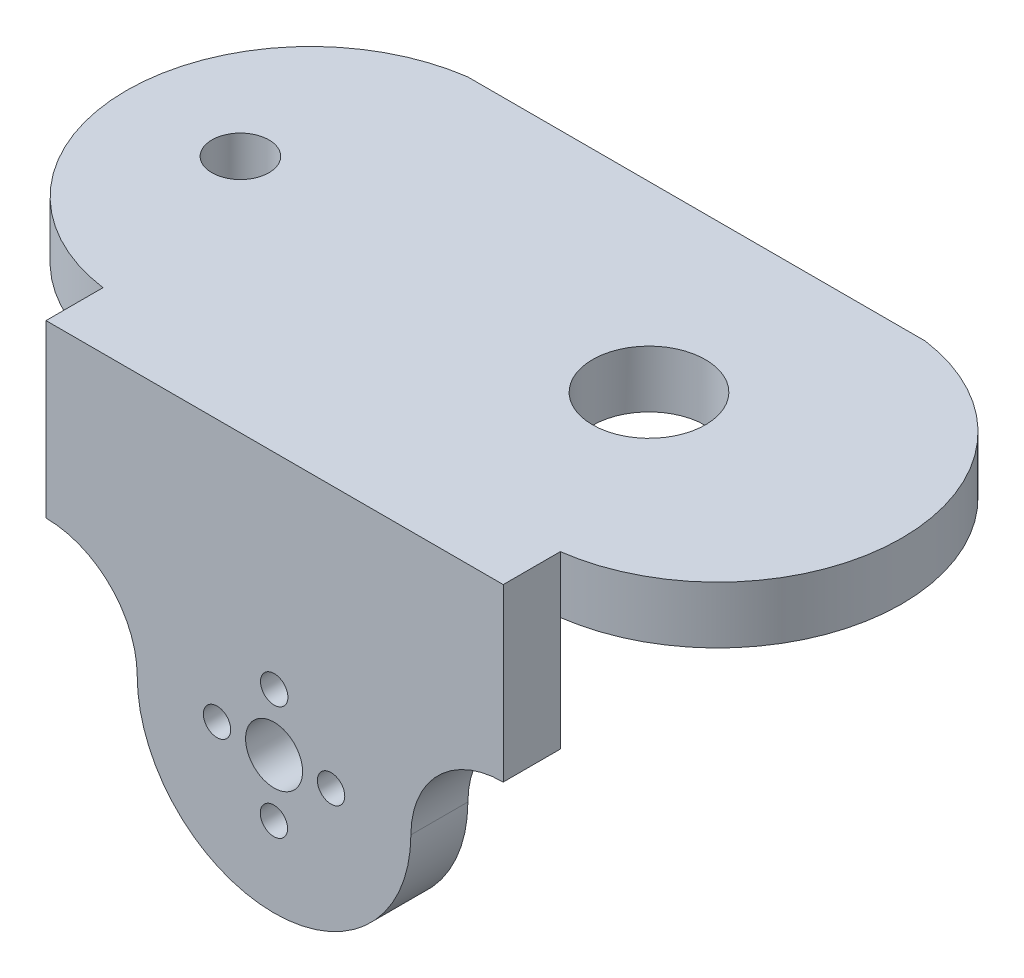
ISO-10303-21;
HEADER;
FILE_DESCRIPTION(('STEP AP214'),'2;1');
FILE_NAME('part.step','',(''),(''),'','','');
FILE_SCHEMA(('AUTOMOTIVE_DESIGN { 1 0 10303 214 1 1 1 1 }'));
ENDSEC;
DATA;
#1=APPLICATION_CONTEXT('core data for automotive mechanical design processes');
#2=APPLICATION_PROTOCOL_DEFINITION('international standard','automotive_design',2000,#1);
#3=PRODUCT_CONTEXT('',#1,'mechanical');
#4=PRODUCT('Part','Part','',(#3));
#5=PRODUCT_RELATED_PRODUCT_CATEGORY('part','',(#4));
#6=PRODUCT_DEFINITION_FORMATION('','',#4);
#7=PRODUCT_DEFINITION_CONTEXT('part definition',#1,'design');
#8=PRODUCT_DEFINITION('design','',#6,#7);
#9=PRODUCT_DEFINITION_SHAPE('','',#8);
#10=(LENGTH_UNIT() NAMED_UNIT(*) SI_UNIT(.MILLI.,.METRE.));
#11=(NAMED_UNIT(*) PLANE_ANGLE_UNIT() SI_UNIT($,.RADIAN.));
#12=(NAMED_UNIT(*) SI_UNIT($,.STERADIAN.) SOLID_ANGLE_UNIT());
#13=UNCERTAINTY_MEASURE_WITH_UNIT(LENGTH_MEASURE(1.E-05),#10,'distance_accuracy_value','');
#14=(GEOMETRIC_REPRESENTATION_CONTEXT(3) GLOBAL_UNCERTAINTY_ASSIGNED_CONTEXT((#13)) GLOBAL_UNIT_ASSIGNED_CONTEXT((#10,
#11,#12)) REPRESENTATION_CONTEXT('',''));
#15=CARTESIAN_POINT('',(0.,0.,0.));
#16=DIRECTION('',(0.,0.,1.));
#17=DIRECTION('',(1.,0.,0.));
#18=AXIS2_PLACEMENT_3D('',#15,#16,#17);
#19=CARTESIAN_POINT('',(40.1,0.,5.));
#20=DIRECTION('',(1.,0.,0.));
#21=DIRECTION('',(0.,0.,-1.));
#22=AXIS2_PLACEMENT_3D('',#19,#20,#21);
#23=PLANE('',#22);
#24=DIRECTION('',(0.,1.,0.));
#25=VECTOR('',#24,1.);
#26=CARTESIAN_POINT('',(40.1,-34.9084875066222,0.));
#27=LINE('',#26,#25);
#28=CARTESIAN_POINT('',(40.1,0.,0.));
#29=VERTEX_POINT('',#28);
#30=CARTESIAN_POINT('',(40.1,5.,0.));
#31=VERTEX_POINT('',#30);
#32=EDGE_CURVE('E56',#29,#31,#27,.T.);
#33=ORIENTED_EDGE('',*,*,#32,.T.);
#34=DIRECTION('',(0.,0.,1.));
#35=VECTOR('',#34,1.);
#36=CARTESIAN_POINT('',(40.1,5.,-32.));
#37=LINE('',#36,#35);
#38=CARTESIAN_POINT('',(40.1,5.,5.));
#39=VERTEX_POINT('',#38);
#40=EDGE_CURVE('E122',#31,#39,#37,.T.);
#41=ORIENTED_EDGE('',*,*,#40,.T.);
#42=DIRECTION('',(0.,-1.,0.));
#43=VECTOR('',#42,1.);
#44=CARTESIAN_POINT('',(40.1,0.,5.));
#45=LINE('',#44,#43);
#46=CARTESIAN_POINT('',(40.1,-10.,5.));
#47=VERTEX_POINT('',#46);
#48=EDGE_CURVE('E159',#39,#47,#45,.T.);
#49=ORIENTED_EDGE('',*,*,#48,.T.);
#50=DIRECTION('',(0.,0.,-1.));
#51=VECTOR('',#50,1.);
#52=CARTESIAN_POINT('',(40.1,-10.,5.));
#53=LINE('',#52,#51);
#54=CARTESIAN_POINT('',(40.1,-10.,0.));
#55=VERTEX_POINT('',#54);
#56=EDGE_CURVE('E171',#47,#55,#53,.T.);
#57=ORIENTED_EDGE('',*,*,#56,.T.);
#58=DIRECTION('',(0.,-1.,0.));
#59=VECTOR('',#58,1.);
#60=CARTESIAN_POINT('',(40.1,0.,0.));
#61=LINE('',#60,#59);
#62=EDGE_CURVE('E157',#29,#55,#61,.T.);
#63=ORIENTED_EDGE('',*,*,#62,.F.);
#64=EDGE_LOOP('',(#33,#41,#49,#57,#63));
#65=FACE_BOUND('',#64,.T.);
#66=ADVANCED_FACE('F40',(#65),#23,.T.);
#67=CARTESIAN_POINT('',(0.,0.,5.));
#68=DIRECTION('',(1.,0.,0.));
#69=DIRECTION('',(0.,1.,0.));
#70=AXIS2_PLACEMENT_3D('',#67,#68,#69);
#71=PLANE('',#70);
#72=DIRECTION('',(0.,0.,1.));
#73=VECTOR('',#72,1.);
#74=CARTESIAN_POINT('',(0.,5.,-32.));
#75=LINE('',#74,#73);
#76=CARTESIAN_POINT('',(0.,5.,0.));
#77=VERTEX_POINT('',#76);
#78=CARTESIAN_POINT('',(0.,5.,5.));
#79=VERTEX_POINT('',#78);
#80=EDGE_CURVE('E64',#77,#79,#75,.T.);
#81=ORIENTED_EDGE('',*,*,#80,.F.);
#82=DIRECTION('',(0.,1.,0.));
#83=VECTOR('',#82,1.);
#84=CARTESIAN_POINT('',(0.,-34.9084875066222,0.));
#85=LINE('',#84,#83);
#86=CARTESIAN_POINT('',(0.,0.,0.));
#87=VERTEX_POINT('',#86);
#88=EDGE_CURVE('E149',#87,#77,#85,.T.);
#89=ORIENTED_EDGE('',*,*,#88,.F.);
#90=DIRECTION('',(0.,-1.,0.));
#91=VECTOR('',#90,1.);
#92=CARTESIAN_POINT('',(0.,0.,0.));
#93=LINE('',#92,#91);
#94=CARTESIAN_POINT('',(0.,-10.,0.));
#95=VERTEX_POINT('',#94);
#96=EDGE_CURVE('E177',#87,#95,#93,.T.);
#97=ORIENTED_EDGE('',*,*,#96,.T.);
#98=DIRECTION('',(0.,0.,-1.));
#99=VECTOR('',#98,1.);
#100=CARTESIAN_POINT('',(0.,-10.,5.));
#101=LINE('',#100,#99);
#102=CARTESIAN_POINT('',(0.,-10.,5.));
#103=VERTEX_POINT('',#102);
#104=EDGE_CURVE('E11',#103,#95,#101,.T.);
#105=ORIENTED_EDGE('',*,*,#104,.F.);
#106=DIRECTION('',(0.,-1.,0.));
#107=VECTOR('',#106,1.);
#108=CARTESIAN_POINT('',(0.,0.,5.));
#109=LINE('',#108,#107);
#110=EDGE_CURVE('E162',#79,#103,#109,.T.);
#111=ORIENTED_EDGE('',*,*,#110,.F.);
#112=EDGE_LOOP('',(#81,#89,#97,#105,#111));
#113=FACE_BOUND('',#112,.T.);
#114=ADVANCED_FACE('F225',(#113),#71,.F.);
#115=CARTESIAN_POINT('',(0.,-18.,5.));
#116=DIRECTION('',(0.,0.,-1.));
#117=DIRECTION('',(-1.,0.,0.));
#118=AXIS2_PLACEMENT_3D('',#115,#116,#117);
#119=CYLINDRICAL_SURFACE('',#118,8.);
#120=CARTESIAN_POINT('',(0.,-18.,0.));
#121=DIRECTION('',(0.,0.,1.));
#122=DIRECTION('',(1.,0.,0.));
#123=AXIS2_PLACEMENT_3D('',#120,#121,#122);
#124=CIRCLE('',#123,8.);
#125=CARTESIAN_POINT('',(8.,-18.,0.));
#126=VERTEX_POINT('',#125);
#127=EDGE_CURVE('E179',#95,#126,#124,.F.);
#128=ORIENTED_EDGE('',*,*,#127,.T.);
#129=DIRECTION('',(0.,0.,-1.));
#130=VECTOR('',#129,1.);
#131=CARTESIAN_POINT('',(8.,-18.,5.));
#132=LINE('',#131,#130);
#133=CARTESIAN_POINT('',(8.,-18.,5.));
#134=VERTEX_POINT('',#133);
#135=EDGE_CURVE('E48',#134,#126,#132,.T.);
#136=ORIENTED_EDGE('',*,*,#135,.F.);
#137=CARTESIAN_POINT('',(0.,-18.,5.));
#138=DIRECTION('',(0.,0.,1.));
#139=DIRECTION('',(1.,0.,0.));
#140=AXIS2_PLACEMENT_3D('',#137,#138,#139);
#141=CIRCLE('',#140,8.);
#142=EDGE_CURVE('E165',#103,#134,#141,.F.);
#143=ORIENTED_EDGE('',*,*,#142,.F.);
#144=ORIENTED_EDGE('',*,*,#104,.T.);
#145=EDGE_LOOP('',(#128,#136,#143,#144));
#146=FACE_BOUND('',#145,.T.);
#147=ADVANCED_FACE('F229',(#146),#119,.F.);
#148=CARTESIAN_POINT('',(20.,-18.,5.));
#149=DIRECTION('',(0.,0.,-1.));
#150=DIRECTION('',(-1.,0.,0.));
#151=AXIS2_PLACEMENT_3D('',#148,#149,#150);
#152=CYLINDRICAL_SURFACE('',#151,12.);
#153=CARTESIAN_POINT('',(20.,-18.,0.));
#154=DIRECTION('',(0.,0.,1.));
#155=DIRECTION('',(1.,0.,0.));
#156=AXIS2_PLACEMENT_3D('',#153,#154,#155);
#157=CIRCLE('',#156,12.);
#158=CARTESIAN_POINT('',(31.999850748125,-18.0598500018656,0.));
#159=VERTEX_POINT('',#158);
#160=EDGE_CURVE('E181',#126,#159,#157,.T.);
#161=ORIENTED_EDGE('',*,*,#160,.T.);
#162=DIRECTION('',(0.,0.,-1.));
#163=VECTOR('',#162,1.);
#164=CARTESIAN_POINT('',(31.999850748125,-18.0598500018656,5.));
#165=LINE('',#164,#163);
#166=CARTESIAN_POINT('',(31.999850748125,-18.0598500018656,5.));
#167=VERTEX_POINT('',#166);
#168=EDGE_CURVE('E186',#167,#159,#165,.T.);
#169=ORIENTED_EDGE('',*,*,#168,.F.);
#170=CARTESIAN_POINT('',(20.,-18.,5.));
#171=DIRECTION('',(0.,0.,1.));
#172=DIRECTION('',(1.,0.,0.));
#173=AXIS2_PLACEMENT_3D('',#170,#171,#172);
#174=CIRCLE('',#173,12.);
#175=EDGE_CURVE('E167',#134,#167,#174,.T.);
#176=ORIENTED_EDGE('',*,*,#175,.F.);
#177=ORIENTED_EDGE('',*,*,#135,.T.);
#178=EDGE_LOOP('',(#161,#169,#176,#177));
#179=FACE_BOUND('',#178,.T.);
#180=ADVANCED_FACE('F233',(#179),#152,.T.);
#181=CARTESIAN_POINT('',(40.1,-18.10025,5.));
#182=DIRECTION('',(0.,0.,-1.));
#183=DIRECTION('',(-1.,0.,0.));
#184=AXIS2_PLACEMENT_3D('',#181,#182,#183);
#185=CYLINDRICAL_SURFACE('',#184,8.10025);
#186=CARTESIAN_POINT('',(40.1,-18.10025,0.));
#187=DIRECTION('',(0.,0.,1.));
#188=DIRECTION('',(1.,0.,0.));
#189=AXIS2_PLACEMENT_3D('',#186,#187,#188);
#190=CIRCLE('',#189,8.10025);
#191=EDGE_CURVE('E163',#159,#55,#190,.F.);
#192=ORIENTED_EDGE('',*,*,#191,.T.);
#193=ORIENTED_EDGE('',*,*,#56,.F.);
#194=CARTESIAN_POINT('',(40.1,-18.10025,5.));
#195=DIRECTION('',(0.,0.,1.));
#196=DIRECTION('',(1.,0.,0.));
#197=AXIS2_PLACEMENT_3D('',#194,#195,#196);
#198=CIRCLE('',#197,8.10025);
#199=EDGE_CURVE('E169',#167,#47,#198,.F.);
#200=ORIENTED_EDGE('',*,*,#199,.F.);
#201=ORIENTED_EDGE('',*,*,#168,.T.);
#202=EDGE_LOOP('',(#192,#193,#200,#201));
#203=FACE_BOUND('',#202,.T.);
#204=ADVANCED_FACE('F239',(#203),#185,.F.);
#205=CARTESIAN_POINT('',(0.,0.,5.));
#206=DIRECTION('',(0.,0.,1.));
#207=DIRECTION('',(1.,0.,0.));
#208=AXIS2_PLACEMENT_3D('',#205,#206,#207);
#209=PLANE('',#208);
#210=CARTESIAN_POINT('',(20.0124688279302,-13.,5.));
#211=DIRECTION('',(0.,0.,1.));
#212=DIRECTION('',(1.,0.,0.));
#213=AXIS2_PLACEMENT_3D('',#210,#211,#212);
#214=CIRCLE('',#213,1.2);
#215=CARTESIAN_POINT('',(21.2124688279302,-13.,5.));
#216=VERTEX_POINT('',#215);
#217=EDGE_CURVE('E195',#216,#216,#214,.T.);
#218=ORIENTED_EDGE('',*,*,#217,.F.);
#219=EDGE_LOOP('',(#218));
#220=FACE_BOUND('',#219,.T.);
#221=CARTESIAN_POINT('',(25.,-18.0249378109453,5.));
#222=DIRECTION('',(0.,0.,1.));
#223=DIRECTION('',(1.,0.,0.));
#224=AXIS2_PLACEMENT_3D('',#221,#222,#223);
#225=CIRCLE('',#224,1.2);
#226=CARTESIAN_POINT('',(26.2,-18.0249378109453,5.));
#227=VERTEX_POINT('',#226);
#228=EDGE_CURVE('E302',#227,#227,#225,.T.);
#229=ORIENTED_EDGE('',*,*,#228,.F.);
#230=EDGE_LOOP('',(#229));
#231=FACE_BOUND('',#230,.T.);
#232=CARTESIAN_POINT('',(19.9875311720698,-23.,5.));
#233=DIRECTION('',(0.,0.,1.));
#234=DIRECTION('',(1.,0.,0.));
#235=AXIS2_PLACEMENT_3D('',#232,#233,#234);
#236=CIRCLE('',#235,1.2);
#237=CARTESIAN_POINT('',(21.1875311720698,-23.,5.));
#238=VERTEX_POINT('',#237);
#239=EDGE_CURVE('E300',#238,#238,#236,.T.);
#240=ORIENTED_EDGE('',*,*,#239,.F.);
#241=EDGE_LOOP('',(#240));
#242=FACE_BOUND('',#241,.T.);
#243=CARTESIAN_POINT('',(15.,-17.9750621890547,5.));
#244=DIRECTION('',(0.,0.,1.));
#245=DIRECTION('',(1.,0.,0.));
#246=AXIS2_PLACEMENT_3D('',#243,#244,#245);
#247=CIRCLE('',#246,1.2);
#248=CARTESIAN_POINT('',(16.2,-17.9750621890547,5.));
#249=VERTEX_POINT('',#248);
#250=EDGE_CURVE('E141',#249,#249,#247,.T.);
#251=ORIENTED_EDGE('',*,*,#250,.F.);
#252=EDGE_LOOP('',(#251));
#253=FACE_BOUND('',#252,.T.);
#254=CARTESIAN_POINT('',(20.,-18.,5.));
#255=DIRECTION('',(0.,0.,1.));
#256=DIRECTION('',(1.,0.,0.));
#257=AXIS2_PLACEMENT_3D('',#254,#255,#256);
#258=CIRCLE('',#257,2.5);
#259=CARTESIAN_POINT('',(22.5,-18.,5.));
#260=VERTEX_POINT('',#259);
#261=EDGE_CURVE('E276',#260,#260,#258,.T.);
#262=ORIENTED_EDGE('',*,*,#261,.F.);
#263=EDGE_LOOP('',(#262));
#264=FACE_BOUND('',#263,.T.);
#265=ORIENTED_EDGE('',*,*,#48,.F.);
#266=DIRECTION('',(-1.,0.,0.));
#267=VECTOR('',#266,1.);
#268=CARTESIAN_POINT('',(0.,5.,5.));
#269=LINE('',#268,#267);
#270=EDGE_CURVE('E151',#39,#79,#269,.T.);
#271=ORIENTED_EDGE('',*,*,#270,.T.);
#272=ORIENTED_EDGE('',*,*,#110,.T.);
#273=ORIENTED_EDGE('',*,*,#142,.T.);
#274=ORIENTED_EDGE('',*,*,#175,.T.);
#275=ORIENTED_EDGE('',*,*,#199,.T.);
#276=EDGE_LOOP('',(#265,#271,#272,#273,#274,#275));
#277=FACE_BOUND('',#276,.T.);
#278=ADVANCED_FACE('F243',(#220,#231,#242,#253,#264,#277),#209,.T.);
#279=CARTESIAN_POINT('',(0.,0.,0.));
#280=DIRECTION('',(0.,0.,1.));
#281=DIRECTION('',(1.,0.,0.));
#282=AXIS2_PLACEMENT_3D('',#279,#280,#281);
#283=PLANE('',#282);
#284=CARTESIAN_POINT('',(20.0124688279302,-13.,0.));
#285=DIRECTION('',(0.,0.,1.));
#286=DIRECTION('',(1.,0.,0.));
#287=AXIS2_PLACEMENT_3D('',#284,#285,#286);
#288=CIRCLE('',#287,1.2);
#289=CARTESIAN_POINT('',(21.2124688279302,-13.,0.));
#290=VERTEX_POINT('',#289);
#291=EDGE_CURVE('E43',#290,#290,#288,.T.);
#292=ORIENTED_EDGE('',*,*,#291,.T.);
#293=EDGE_LOOP('',(#292));
#294=FACE_BOUND('',#293,.T.);
#295=CARTESIAN_POINT('',(25.,-18.0249378109453,0.));
#296=DIRECTION('',(0.,0.,1.));
#297=DIRECTION('',(1.,0.,0.));
#298=AXIS2_PLACEMENT_3D('',#295,#296,#297);
#299=CIRCLE('',#298,1.2);
#300=CARTESIAN_POINT('',(26.2,-18.0249378109453,0.));
#301=VERTEX_POINT('',#300);
#302=EDGE_CURVE('E138',#301,#301,#299,.T.);
#303=ORIENTED_EDGE('',*,*,#302,.T.);
#304=EDGE_LOOP('',(#303));
#305=FACE_BOUND('',#304,.T.);
#306=CARTESIAN_POINT('',(19.9875311720698,-23.,0.));
#307=DIRECTION('',(0.,0.,1.));
#308=DIRECTION('',(1.,0.,0.));
#309=AXIS2_PLACEMENT_3D('',#306,#307,#308);
#310=CIRCLE('',#309,1.2);
#311=CARTESIAN_POINT('',(21.1875311720698,-23.,0.));
#312=VERTEX_POINT('',#311);
#313=EDGE_CURVE('E198',#312,#312,#310,.T.);
#314=ORIENTED_EDGE('',*,*,#313,.T.);
#315=EDGE_LOOP('',(#314));
#316=FACE_BOUND('',#315,.T.);
#317=CARTESIAN_POINT('',(15.,-17.9750621890547,0.));
#318=DIRECTION('',(0.,0.,1.));
#319=DIRECTION('',(1.,0.,0.));
#320=AXIS2_PLACEMENT_3D('',#317,#318,#319);
#321=CIRCLE('',#320,1.2);
#322=CARTESIAN_POINT('',(16.2,-17.9750621890547,0.));
#323=VERTEX_POINT('',#322);
#324=EDGE_CURVE('E194',#323,#323,#321,.T.);
#325=ORIENTED_EDGE('',*,*,#324,.T.);
#326=EDGE_LOOP('',(#325));
#327=FACE_BOUND('',#326,.T.);
#328=CARTESIAN_POINT('',(20.,-18.,0.));
#329=DIRECTION('',(0.,0.,1.));
#330=DIRECTION('',(1.,0.,0.));
#331=AXIS2_PLACEMENT_3D('',#328,#329,#330);
#332=CIRCLE('',#331,2.5);
#333=CARTESIAN_POINT('',(22.5,-18.,0.));
#334=VERTEX_POINT('',#333);
#335=EDGE_CURVE('E191',#334,#334,#332,.T.);
#336=ORIENTED_EDGE('',*,*,#335,.T.);
#337=EDGE_LOOP('',(#336));
#338=FACE_BOUND('',#337,.T.);
#339=ORIENTED_EDGE('',*,*,#62,.T.);
#340=ORIENTED_EDGE('',*,*,#191,.F.);
#341=ORIENTED_EDGE('',*,*,#160,.F.);
#342=ORIENTED_EDGE('',*,*,#127,.F.);
#343=ORIENTED_EDGE('',*,*,#96,.F.);
#344=DIRECTION('',(1.,0.,0.));
#345=VECTOR('',#344,1.);
#346=CARTESIAN_POINT('',(0.,0.,0.));
#347=LINE('',#346,#345);
#348=EDGE_CURVE('E174',#87,#29,#347,.T.);
#349=ORIENTED_EDGE('',*,*,#348,.T.);
#350=EDGE_LOOP('',(#339,#340,#341,#342,#343,#349));
#351=FACE_BOUND('',#350,.T.);
#352=ADVANCED_FACE('F203',(#294,#305,#316,#327,#338,#351),#283,.F.);
#353=CARTESIAN_POINT('',(0.,0.,-32.));
#354=DIRECTION('',(0.,-1.,0.));
#355=DIRECTION('',(0.,0.,-1.));
#356=AXIS2_PLACEMENT_3D('',#353,#354,#355);
#357=PLANE('',#356);
#358=CARTESIAN_POINT('',(31.88,0.,-16.));
#359=DIRECTION('',(0.,-1.,0.));
#360=DIRECTION('',(0.,0.,-1.));
#361=AXIS2_PLACEMENT_3D('',#358,#359,#360);
#362=CIRCLE('',#361,4.95499999999998);
#363=CARTESIAN_POINT('',(31.88,0.,-20.955));
#364=VERTEX_POINT('',#363);
#365=EDGE_CURVE('E304',#364,#364,#362,.T.);
#366=ORIENTED_EDGE('',*,*,#365,.F.);
#367=EDGE_LOOP('',(#366));
#368=FACE_BOUND('',#367,.T.);
#369=CARTESIAN_POINT('',(-3.95,0.,-16.));
#370=DIRECTION('',(0.,-1.,0.));
#371=DIRECTION('',(0.,0.,-1.));
#372=AXIS2_PLACEMENT_3D('',#369,#370,#371);
#373=CIRCLE('',#372,2.5);
#374=CARTESIAN_POINT('',(-3.95,0.,-18.5));
#375=VERTEX_POINT('',#374);
#376=EDGE_CURVE('E309',#375,#375,#373,.T.);
#377=ORIENTED_EDGE('',*,*,#376,.F.);
#378=EDGE_LOOP('',(#377));
#379=FACE_BOUND('',#378,.T.);
#380=ORIENTED_EDGE('',*,*,#348,.F.);
#381=CARTESIAN_POINT('',(2.20062724014337,0.,-16.));
#382=DIRECTION('',(0.,-1.,0.));
#383=DIRECTION('',(0.,0.,-1.));
#384=AXIS2_PLACEMENT_3D('',#381,#382,#383);
#385=CIRCLE('',#384,16.1506272401434);
#386=CARTESIAN_POINT('',(0.,0.,-32.));
#387=VERTEX_POINT('',#386);
#388=EDGE_CURVE('E146',#387,#87,#385,.F.);
#389=ORIENTED_EDGE('',*,*,#388,.F.);
#390=DIRECTION('',(1.,0.,0.));
#391=VECTOR('',#390,1.);
#392=CARTESIAN_POINT('',(0.,0.,-32.));
#393=LINE('',#392,#391);
#394=CARTESIAN_POINT('',(40.1,0.,-32.));
#395=VERTEX_POINT('',#394);
#396=EDGE_CURVE('E131',#387,#395,#393,.T.);
#397=ORIENTED_EDGE('',*,*,#396,.T.);
#398=CARTESIAN_POINT('',(37.8993727598566,0.,-16.));
#399=DIRECTION('',(0.,-1.,0.));
#400=DIRECTION('',(0.,0.,-1.));
#401=AXIS2_PLACEMENT_3D('',#398,#399,#400);
#402=CIRCLE('',#401,16.1506272401434);
#403=EDGE_CURVE('E130',#29,#395,#402,.F.);
#404=ORIENTED_EDGE('',*,*,#403,.F.);
#405=EDGE_LOOP('',(#380,#389,#397,#404));
#406=FACE_BOUND('',#405,.T.);
#407=ADVANCED_FACE('F247',(#368,#379,#406),#357,.T.);
#408=CARTESIAN_POINT('',(0.,5.,-32.));
#409=DIRECTION('',(0.,1.,0.));
#410=DIRECTION('',(0.,0.,1.));
#411=AXIS2_PLACEMENT_3D('',#408,#409,#410);
#412=PLANE('',#411);
#413=CARTESIAN_POINT('',(31.88,5.,-16.));
#414=DIRECTION('',(0.,1.,0.));
#415=DIRECTION('',(0.,0.,1.));
#416=AXIS2_PLACEMENT_3D('',#413,#414,#415);
#417=CIRCLE('',#416,4.95499999999998);
#418=CARTESIAN_POINT('',(31.88,5.,-11.045));
#419=VERTEX_POINT('',#418);
#420=EDGE_CURVE('E312',#419,#419,#417,.T.);
#421=ORIENTED_EDGE('',*,*,#420,.F.);
#422=EDGE_LOOP('',(#421));
#423=FACE_BOUND('',#422,.T.);
#424=CARTESIAN_POINT('',(-3.95,5.,-16.));
#425=DIRECTION('',(0.,1.,0.));
#426=DIRECTION('',(0.,0.,1.));
#427=AXIS2_PLACEMENT_3D('',#424,#425,#426);
#428=CIRCLE('',#427,2.5);
#429=CARTESIAN_POINT('',(-3.95,5.,-13.5));
#430=VERTEX_POINT('',#429);
#431=EDGE_CURVE('E313',#430,#430,#428,.T.);
#432=ORIENTED_EDGE('',*,*,#431,.F.);
#433=EDGE_LOOP('',(#432));
#434=FACE_BOUND('',#433,.T.);
#435=ORIENTED_EDGE('',*,*,#270,.F.);
#436=ORIENTED_EDGE('',*,*,#40,.F.);
#437=CARTESIAN_POINT('',(37.8993727598566,5.,-16.));
#438=DIRECTION('',(0.,1.,0.));
#439=DIRECTION('',(0.,0.,1.));
#440=AXIS2_PLACEMENT_3D('',#437,#438,#439);
#441=CIRCLE('',#440,16.1506272401434);
#442=CARTESIAN_POINT('',(40.1,5.,-32.));
#443=VERTEX_POINT('',#442);
#444=EDGE_CURVE('E128',#31,#443,#441,.T.);
#445=ORIENTED_EDGE('',*,*,#444,.T.);
#446=DIRECTION('',(-1.,0.,0.));
#447=VECTOR('',#446,1.);
#448=CARTESIAN_POINT('',(0.,5.,-32.));
#449=LINE('',#448,#447);
#450=CARTESIAN_POINT('',(0.,5.,-32.));
#451=VERTEX_POINT('',#450);
#452=EDGE_CURVE('E111',#443,#451,#449,.T.);
#453=ORIENTED_EDGE('',*,*,#452,.T.);
#454=CARTESIAN_POINT('',(2.20062724014337,5.,-16.));
#455=DIRECTION('',(0.,1.,0.));
#456=DIRECTION('',(0.,0.,-1.));
#457=AXIS2_PLACEMENT_3D('',#454,#455,#456);
#458=CIRCLE('',#457,16.1506272401434);
#459=EDGE_CURVE('E143',#451,#77,#458,.T.);
#460=ORIENTED_EDGE('',*,*,#459,.T.);
#461=ORIENTED_EDGE('',*,*,#80,.T.);
#462=EDGE_LOOP('',(#435,#436,#445,#453,#460,#461));
#463=FACE_BOUND('',#462,.T.);
#464=ADVANCED_FACE('F134',(#423,#434,#463),#412,.T.);
#465=CARTESIAN_POINT('',(0.,0.,-32.));
#466=DIRECTION('',(0.,0.,-1.));
#467=DIRECTION('',(-1.,0.,0.));
#468=AXIS2_PLACEMENT_3D('',#465,#466,#467);
#469=PLANE('',#468);
#470=DIRECTION('',(0.,-1.,0.));
#471=VECTOR('',#470,1.);
#472=CARTESIAN_POINT('',(0.,0.,-32.));
#473=LINE('',#472,#471);
#474=EDGE_CURVE('E117',#451,#387,#473,.T.);
#475=ORIENTED_EDGE('',*,*,#474,.F.);
#476=ORIENTED_EDGE('',*,*,#452,.F.);
#477=DIRECTION('',(0.,1.,0.));
#478=VECTOR('',#477,1.);
#479=CARTESIAN_POINT('',(40.1,0.,-32.));
#480=LINE('',#479,#478);
#481=EDGE_CURVE('E114',#395,#443,#480,.T.);
#482=ORIENTED_EDGE('',*,*,#481,.F.);
#483=ORIENTED_EDGE('',*,*,#396,.F.);
#484=EDGE_LOOP('',(#475,#476,#482,#483));
#485=FACE_BOUND('',#484,.T.);
#486=ADVANCED_FACE('F113',(#485),#469,.T.);
#487=CARTESIAN_POINT('',(2.20062724014337,-34.9084875066222,-16.));
#488=DIRECTION('',(0.,1.,0.));
#489=DIRECTION('',(0.,0.,1.));
#490=AXIS2_PLACEMENT_3D('',#487,#488,#489);
#491=CYLINDRICAL_SURFACE('',#490,16.1506272401434);
#492=ORIENTED_EDGE('',*,*,#474,.T.);
#493=ORIENTED_EDGE('',*,*,#388,.T.);
#494=ORIENTED_EDGE('',*,*,#88,.T.);
#495=ORIENTED_EDGE('',*,*,#459,.F.);
#496=EDGE_LOOP('',(#492,#493,#494,#495));
#497=FACE_BOUND('',#496,.T.);
#498=ADVANCED_FACE('F260',(#497),#491,.T.);
#499=CARTESIAN_POINT('',(37.8993727598566,-34.9084875066222,-16.));
#500=DIRECTION('',(0.,1.,0.));
#501=DIRECTION('',(0.,0.,1.));
#502=AXIS2_PLACEMENT_3D('',#499,#500,#501);
#503=CYLINDRICAL_SURFACE('',#502,16.1506272401434);
#504=ORIENTED_EDGE('',*,*,#32,.F.);
#505=ORIENTED_EDGE('',*,*,#403,.T.);
#506=ORIENTED_EDGE('',*,*,#481,.T.);
#507=ORIENTED_EDGE('',*,*,#444,.F.);
#508=EDGE_LOOP('',(#504,#505,#506,#507));
#509=FACE_BOUND('',#508,.T.);
#510=ADVANCED_FACE('F127',(#509),#503,.T.);
#511=CARTESIAN_POINT('',(20.,-18.,-32.));
#512=DIRECTION('',(0.,0.,1.));
#513=DIRECTION('',(1.,0.,0.));
#514=AXIS2_PLACEMENT_3D('',#511,#512,#513);
#515=CYLINDRICAL_SURFACE('',#514,2.5);
#516=ORIENTED_EDGE('',*,*,#261,.T.);
#517=EDGE_LOOP('',(#516));
#518=FACE_BOUND('',#517,.T.);
#519=ORIENTED_EDGE('',*,*,#335,.F.);
#520=EDGE_LOOP('',(#519));
#521=FACE_BOUND('',#520,.T.);
#522=ADVANCED_FACE('F266',(#518,#521),#515,.F.);
#523=CARTESIAN_POINT('',(15.,-17.9750621890547,-32.));
#524=DIRECTION('',(0.,0.,1.));
#525=DIRECTION('',(1.,0.,0.));
#526=AXIS2_PLACEMENT_3D('',#523,#524,#525);
#527=CYLINDRICAL_SURFACE('',#526,1.2);
#528=ORIENTED_EDGE('',*,*,#250,.T.);
#529=EDGE_LOOP('',(#528));
#530=FACE_BOUND('',#529,.T.);
#531=ORIENTED_EDGE('',*,*,#324,.F.);
#532=EDGE_LOOP('',(#531));
#533=FACE_BOUND('',#532,.T.);
#534=ADVANCED_FACE('F219',(#530,#533),#527,.F.);
#535=CARTESIAN_POINT('',(19.9875311720698,-23.,-32.));
#536=DIRECTION('',(0.,0.,1.));
#537=DIRECTION('',(1.,0.,0.));
#538=AXIS2_PLACEMENT_3D('',#535,#536,#537);
#539=CYLINDRICAL_SURFACE('',#538,1.2);
#540=ORIENTED_EDGE('',*,*,#239,.T.);
#541=EDGE_LOOP('',(#540));
#542=FACE_BOUND('',#541,.T.);
#543=ORIENTED_EDGE('',*,*,#313,.F.);
#544=EDGE_LOOP('',(#543));
#545=FACE_BOUND('',#544,.T.);
#546=ADVANCED_FACE('F209',(#542,#545),#539,.F.);
#547=CARTESIAN_POINT('',(25.,-18.0249378109453,-32.));
#548=DIRECTION('',(0.,0.,1.));
#549=DIRECTION('',(1.,0.,0.));
#550=AXIS2_PLACEMENT_3D('',#547,#548,#549);
#551=CYLINDRICAL_SURFACE('',#550,1.2);
#552=ORIENTED_EDGE('',*,*,#228,.T.);
#553=EDGE_LOOP('',(#552));
#554=FACE_BOUND('',#553,.T.);
#555=ORIENTED_EDGE('',*,*,#302,.F.);
#556=EDGE_LOOP('',(#555));
#557=FACE_BOUND('',#556,.T.);
#558=ADVANCED_FACE('F206',(#554,#557),#551,.F.);
#559=CARTESIAN_POINT('',(20.0124688279302,-13.,-32.));
#560=DIRECTION('',(0.,0.,1.));
#561=DIRECTION('',(1.,0.,0.));
#562=AXIS2_PLACEMENT_3D('',#559,#560,#561);
#563=CYLINDRICAL_SURFACE('',#562,1.2);
#564=ORIENTED_EDGE('',*,*,#217,.T.);
#565=EDGE_LOOP('',(#564));
#566=FACE_BOUND('',#565,.T.);
#567=ORIENTED_EDGE('',*,*,#291,.F.);
#568=EDGE_LOOP('',(#567));
#569=FACE_BOUND('',#568,.T.);
#570=ADVANCED_FACE('F208',(#566,#569),#563,.F.);
#571=CARTESIAN_POINT('',(-3.95,-30.,-16.));
#572=DIRECTION('',(0.,1.,0.));
#573=DIRECTION('',(0.,0.,1.));
#574=AXIS2_PLACEMENT_3D('',#571,#572,#573);
#575=CYLINDRICAL_SURFACE('',#574,2.5);
#576=ORIENTED_EDGE('',*,*,#376,.T.);
#577=EDGE_LOOP('',(#576));
#578=FACE_BOUND('',#577,.T.);
#579=ORIENTED_EDGE('',*,*,#431,.T.);
#580=EDGE_LOOP('',(#579));
#581=FACE_BOUND('',#580,.T.);
#582=ADVANCED_FACE('F216',(#578,#581),#575,.F.);
#583=CARTESIAN_POINT('',(31.88,-30.,-16.));
#584=DIRECTION('',(0.,1.,0.));
#585=DIRECTION('',(0.,0.,1.));
#586=AXIS2_PLACEMENT_3D('',#583,#584,#585);
#587=CYLINDRICAL_SURFACE('',#586,4.95499999999998);
#588=ORIENTED_EDGE('',*,*,#365,.T.);
#589=EDGE_LOOP('',(#588));
#590=FACE_BOUND('',#589,.T.);
#591=ORIENTED_EDGE('',*,*,#420,.T.);
#592=EDGE_LOOP('',(#591));
#593=FACE_BOUND('',#592,.T.);
#594=ADVANCED_FACE('F319',(#590,#593),#587,.F.);
#595=CLOSED_SHELL('',(#66,#114,#147,#180,#204,#278,#352,#407,#464,#486,#498,#510,#522,#534,#546,
#558,#570,#582,#594));
#596=MANIFOLD_SOLID_BREP('B2',#595);
#597=ADVANCED_BREP_SHAPE_REPRESENTATION('',(#18,#596),#14);
#598=SHAPE_DEFINITION_REPRESENTATION(#9,#597);
ENDSEC;
END-ISO-10303-21;
